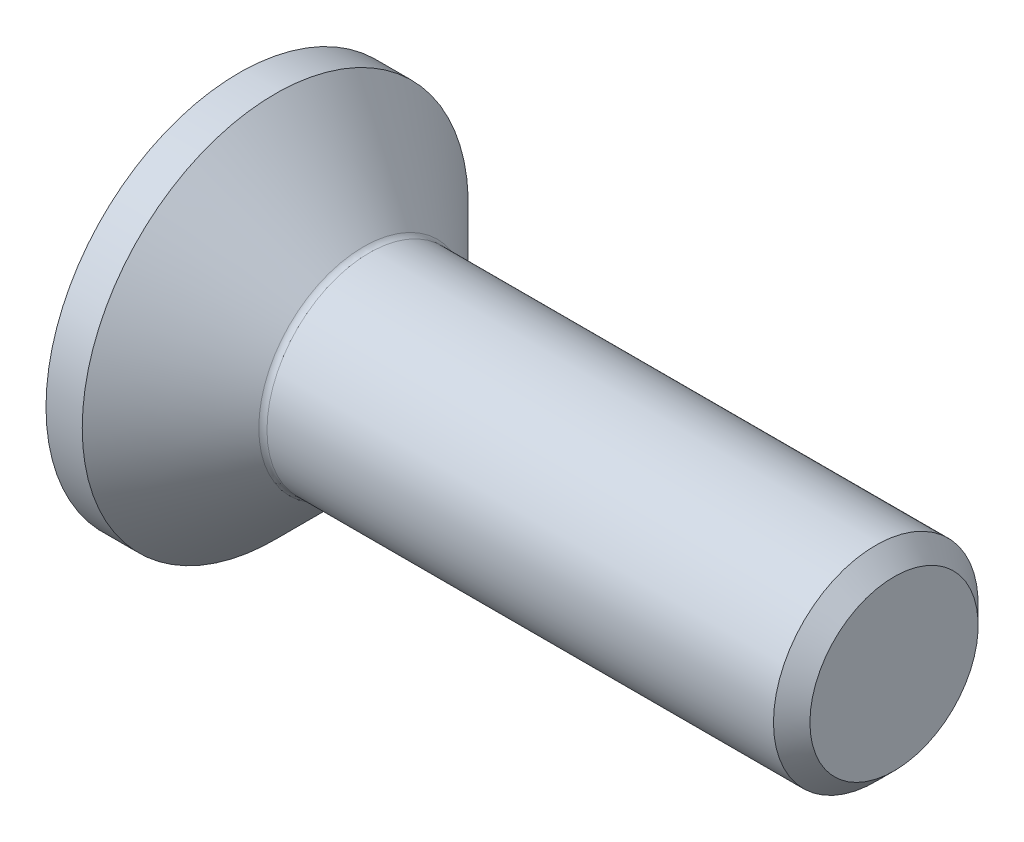
ISO-10303-21;
HEADER;
FILE_DESCRIPTION(('STEP AP214'),'2;1');
FILE_NAME('part.step','',(''),(''),'','','');
FILE_SCHEMA(('AUTOMOTIVE_DESIGN { 1 0 10303 214 1 1 1 1 }'));
ENDSEC;
DATA;
#1=APPLICATION_CONTEXT('core data for automotive mechanical design processes');
#2=APPLICATION_PROTOCOL_DEFINITION('international standard','automotive_design',2000,#1);
#3=PRODUCT_CONTEXT('',#1,'mechanical');
#4=PRODUCT('Part','Part','',(#3));
#5=PRODUCT_RELATED_PRODUCT_CATEGORY('part','',(#4));
#6=PRODUCT_DEFINITION_FORMATION('','',#4);
#7=PRODUCT_DEFINITION_CONTEXT('part definition',#1,'design');
#8=PRODUCT_DEFINITION('design','',#6,#7);
#9=PRODUCT_DEFINITION_SHAPE('','',#8);
#10=(LENGTH_UNIT() NAMED_UNIT(*) SI_UNIT(.MILLI.,.METRE.));
#11=(NAMED_UNIT(*) PLANE_ANGLE_UNIT() SI_UNIT($,.RADIAN.));
#12=(NAMED_UNIT(*) SI_UNIT($,.STERADIAN.) SOLID_ANGLE_UNIT());
#13=UNCERTAINTY_MEASURE_WITH_UNIT(LENGTH_MEASURE(1.E-05),#10,'distance_accuracy_value','');
#14=(GEOMETRIC_REPRESENTATION_CONTEXT(3) GLOBAL_UNCERTAINTY_ASSIGNED_CONTEXT((#13)) GLOBAL_UNIT_ASSIGNED_CONTEXT((#10,
#11,#12)) REPRESENTATION_CONTEXT('',''));
#15=CARTESIAN_POINT('',(0.,0.,0.));
#16=DIRECTION('',(0.,0.,1.));
#17=DIRECTION('',(1.,0.,0.));
#18=AXIS2_PLACEMENT_3D('',#15,#16,#17);
#19=CARTESIAN_POINT('',(0.,0.,0.));
#20=DIRECTION('',(-1.,0.,0.));
#21=DIRECTION('',(0.,0.,1.));
#22=AXIS2_PLACEMENT_3D('',#19,#20,#21);
#23=PLANE('',#22);
#24=CARTESIAN_POINT('',(0.,0.,0.));
#25=DIRECTION('',(-1.,0.,0.));
#26=DIRECTION('',(0.,0.,1.));
#27=AXIS2_PLACEMENT_3D('',#24,#25,#26);
#28=CIRCLE('',#27,4.715);
#29=CARTESIAN_POINT('',(0.,0.,4.715));
#30=VERTEX_POINT('',#29);
#31=EDGE_CURVE('E156',#30,#30,#28,.T.);
#32=ORIENTED_EDGE('',*,*,#31,.T.);
#33=EDGE_LOOP('',(#32));
#34=FACE_BOUND('',#33,.T.);
#35=DIRECTION('',(0.,-0.499999999999999,-0.866025403784439));
#36=VECTOR('',#35,1.);
#37=CARTESIAN_POINT('',(0.,-0.866025403784438,1.5));
#38=LINE('',#37,#36);
#39=CARTESIAN_POINT('',(0.,-0.866025403784438,1.5));
#40=VERTEX_POINT('',#39);
#41=CARTESIAN_POINT('',(0.,-1.73205080756887,0.));
#42=VERTEX_POINT('',#41);
#43=EDGE_CURVE('E122',#40,#42,#38,.T.);
#44=ORIENTED_EDGE('',*,*,#43,.T.);
#45=DIRECTION('',(0.,0.499999999999999,-0.866025403784439));
#46=VECTOR('',#45,1.);
#47=CARTESIAN_POINT('',(0.,-1.73205080756887,0.));
#48=LINE('',#47,#46);
#49=CARTESIAN_POINT('',(0.,-0.866025403784438,-1.5));
#50=VERTEX_POINT('',#49);
#51=EDGE_CURVE('E53',#42,#50,#48,.T.);
#52=ORIENTED_EDGE('',*,*,#51,.T.);
#53=DIRECTION('',(0.,1.,0.));
#54=VECTOR('',#53,1.);
#55=CARTESIAN_POINT('',(0.,-0.866025403784438,-1.5));
#56=LINE('',#55,#54);
#57=CARTESIAN_POINT('',(0.,0.866025403784438,-1.5));
#58=VERTEX_POINT('',#57);
#59=EDGE_CURVE('E133',#50,#58,#56,.T.);
#60=ORIENTED_EDGE('',*,*,#59,.T.);
#61=DIRECTION('',(0.,0.500000000000001,0.866025403784438));
#62=VECTOR('',#61,1.);
#63=CARTESIAN_POINT('',(0.,0.866025403784438,-1.5));
#64=LINE('',#63,#62);
#65=CARTESIAN_POINT('',(0.,1.73205080756888,0.));
#66=VERTEX_POINT('',#65);
#67=EDGE_CURVE('E257',#58,#66,#64,.T.);
#68=ORIENTED_EDGE('',*,*,#67,.T.);
#69=DIRECTION('',(0.,-0.5,0.866025403784438));
#70=VECTOR('',#69,1.);
#71=CARTESIAN_POINT('',(0.,1.73205080756888,0.));
#72=LINE('',#71,#70);
#73=CARTESIAN_POINT('',(0.,0.866025403784438,1.5));
#74=VERTEX_POINT('',#73);
#75=EDGE_CURVE('E260',#66,#74,#72,.T.);
#76=ORIENTED_EDGE('',*,*,#75,.T.);
#77=DIRECTION('',(0.,-1.,0.));
#78=VECTOR('',#77,1.);
#79=CARTESIAN_POINT('',(0.,0.866025403784438,1.5));
#80=LINE('',#79,#78);
#81=EDGE_CURVE('E263',#74,#40,#80,.T.);
#82=ORIENTED_EDGE('',*,*,#81,.T.);
#83=EDGE_LOOP('',(#44,#52,#60,#68,#76,#82));
#84=FACE_BOUND('',#83,.T.);
#85=ADVANCED_FACE('F38',(#34,#84),#23,.T.);
#86=CARTESIAN_POINT('',(0.,0.,0.));
#87=DIRECTION('',(-1.,0.,0.));
#88=DIRECTION('',(0.,0.,1.));
#89=AXIS2_PLACEMENT_3D('',#86,#87,#88);
#90=CYLINDRICAL_SURFACE('',#89,4.715);
#91=CARTESIAN_POINT('',(0.885000000000013,0.,0.));
#92=DIRECTION('',(-1.,0.,0.));
#93=DIRECTION('',(0.,0.,1.));
#94=AXIS2_PLACEMENT_3D('',#91,#92,#93);
#95=CIRCLE('',#94,4.715);
#96=CARTESIAN_POINT('',(0.885000000000013,0.,4.715));
#97=VERTEX_POINT('',#96);
#98=EDGE_CURVE('E153',#97,#97,#95,.T.);
#99=ORIENTED_EDGE('',*,*,#98,.T.);
#100=EDGE_LOOP('',(#99));
#101=FACE_BOUND('',#100,.T.);
#102=ORIENTED_EDGE('',*,*,#31,.F.);
#103=EDGE_LOOP('',(#102));
#104=FACE_BOUND('',#103,.T.);
#105=ADVANCED_FACE('F177',(#101,#104),#90,.T.);
#106=CARTESIAN_POINT('',(0.885000000000013,0.,0.));
#107=DIRECTION('',(-1.,0.,0.));
#108=DIRECTION('',(0.,0.,1.));
#109=AXIS2_PLACEMENT_3D('',#106,#107,#108);
#110=CONICAL_SURFACE('',#109,4.715,0.78539816339745);
#111=CARTESIAN_POINT('',(3.04142135623734,0.,0.));
#112=DIRECTION('',(-1.,0.,0.));
#113=DIRECTION('',(0.,0.,1.));
#114=AXIS2_PLACEMENT_3D('',#111,#112,#113);
#115=CIRCLE('',#114,2.55857864376267);
#116=CARTESIAN_POINT('',(3.04142135623734,0.,2.55857864376267));
#117=VERTEX_POINT('',#116);
#118=EDGE_CURVE('E46',#117,#117,#115,.T.);
#119=ORIENTED_EDGE('',*,*,#118,.T.);
#120=EDGE_LOOP('',(#119));
#121=FACE_BOUND('',#120,.T.);
#122=ORIENTED_EDGE('',*,*,#98,.F.);
#123=EDGE_LOOP('',(#122));
#124=FACE_BOUND('',#123,.T.);
#125=ADVANCED_FACE('F161',(#121,#124),#110,.T.);
#126=CARTESIAN_POINT('',(0.,0.,0.));
#127=DIRECTION('',(-1.,0.,0.));
#128=DIRECTION('',(0.,0.,1.));
#129=AXIS2_PLACEMENT_3D('',#126,#127,#128);
#130=CYLINDRICAL_SURFACE('',#129,2.49999999999998);
#131=CARTESIAN_POINT('',(3.18284271247464,0.,0.));
#132=DIRECTION('',(-1.,0.,0.));
#133=DIRECTION('',(0.,0.,1.));
#134=AXIS2_PLACEMENT_3D('',#131,#132,#133);
#135=CIRCLE('',#134,2.49999999999998);
#136=CARTESIAN_POINT('',(3.18284271247464,0.,2.49999999999998));
#137=VERTEX_POINT('',#136);
#138=EDGE_CURVE('E11',#137,#137,#135,.F.);
#139=ORIENTED_EDGE('',*,*,#138,.T.);
#140=EDGE_LOOP('',(#139));
#141=FACE_BOUND('',#140,.T.);
#142=CARTESIAN_POINT('',(15.555,0.,0.));
#143=DIRECTION('',(-1.,0.,0.));
#144=DIRECTION('',(0.,0.,1.));
#145=AXIS2_PLACEMENT_3D('',#142,#143,#144);
#146=CIRCLE('',#145,2.49999999999996);
#147=CARTESIAN_POINT('',(15.555,0.,2.49999999999996));
#148=VERTEX_POINT('',#147);
#149=EDGE_CURVE('E150',#148,#148,#146,.T.);
#150=ORIENTED_EDGE('',*,*,#149,.T.);
#151=EDGE_LOOP('',(#150));
#152=FACE_BOUND('',#151,.T.);
#153=ADVANCED_FACE('F188',(#141,#152),#130,.T.);
#154=CARTESIAN_POINT('',(16.,0.,0.));
#155=DIRECTION('',(-1.,0.,0.));
#156=DIRECTION('',(0.,0.,1.));
#157=AXIS2_PLACEMENT_3D('',#154,#155,#156);
#158=CONICAL_SURFACE('',#157,2.055,0.785398163397368);
#159=ORIENTED_EDGE('',*,*,#149,.F.);
#160=EDGE_LOOP('',(#159));
#161=FACE_BOUND('',#160,.T.);
#162=CARTESIAN_POINT('',(16.,0.,0.));
#163=DIRECTION('',(-1.,0.,0.));
#164=DIRECTION('',(0.,0.,1.));
#165=AXIS2_PLACEMENT_3D('',#162,#163,#164);
#166=CIRCLE('',#165,2.055);
#167=CARTESIAN_POINT('',(16.,0.,2.055));
#168=VERTEX_POINT('',#167);
#169=EDGE_CURVE('E146',#168,#168,#166,.T.);
#170=ORIENTED_EDGE('',*,*,#169,.T.);
#171=EDGE_LOOP('',(#170));
#172=FACE_BOUND('',#171,.T.);
#173=ADVANCED_FACE('F172',(#161,#172),#158,.T.);
#174=CARTESIAN_POINT('',(16.,2.055,0.));
#175=DIRECTION('',(1.,0.,0.));
#176=DIRECTION('',(0.,0.,-1.));
#177=AXIS2_PLACEMENT_3D('',#174,#175,#176);
#178=PLANE('',#177);
#179=ORIENTED_EDGE('',*,*,#169,.F.);
#180=EDGE_LOOP('',(#179));
#181=FACE_BOUND('',#180,.T.);
#182=ADVANCED_FACE('F165',(#181),#178,.T.);
#183=CARTESIAN_POINT('',(3.18284271247464,0.,0.));
#184=DIRECTION('',(-1.,0.,0.));
#185=DIRECTION('',(0.,0.,1.));
#186=AXIS2_PLACEMENT_3D('',#183,#184,#185);
#187=TOROIDAL_SURFACE('',#186,2.69999999999998,0.2);
#188=ORIENTED_EDGE('',*,*,#138,.F.);
#189=EDGE_LOOP('',(#188));
#190=FACE_BOUND('',#189,.T.);
#191=ORIENTED_EDGE('',*,*,#118,.F.);
#192=EDGE_LOOP('',(#191));
#193=FACE_BOUND('',#192,.T.);
#194=ADVANCED_FACE('F40',(#190,#193),#187,.F.);
#195=CARTESIAN_POINT('',(1.9,-1.73205080756887,0.));
#196=DIRECTION('',(0.,0.866025403784439,0.499999999999999));
#197=DIRECTION('',(0.,-0.499999999999999,0.866025403784439));
#198=AXIS2_PLACEMENT_3D('',#195,#196,#197);
#199=PLANE('',#198);
#200=ORIENTED_EDGE('',*,*,#51,.F.);
#201=DIRECTION('',(-1.,0.,0.));
#202=VECTOR('',#201,1.);
#203=CARTESIAN_POINT('',(1.9,-1.73205080756887,0.));
#204=LINE('',#203,#202);
#205=CARTESIAN_POINT('',(1.9,-1.73205080756887,0.));
#206=VERTEX_POINT('',#205);
#207=EDGE_CURVE('E254',#206,#42,#204,.T.);
#208=ORIENTED_EDGE('',*,*,#207,.F.);
#209=DIRECTION('',(0.,0.499999999999999,-0.866025403784439));
#210=VECTOR('',#209,1.);
#211=CARTESIAN_POINT('',(1.9,-1.73205080756887,0.));
#212=LINE('',#211,#210);
#213=CARTESIAN_POINT('',(1.9,-1.29903810567666,-0.749999999999998));
#214=VERTEX_POINT('',#213);
#215=EDGE_CURVE('E118',#206,#214,#212,.T.);
#216=ORIENTED_EDGE('',*,*,#215,.T.);
#217=CARTESIAN_POINT('',(1.9,-0.866025403784438,-1.5));
#218=VERTEX_POINT('',#217);
#219=EDGE_CURVE('E114',#214,#218,#212,.T.);
#220=ORIENTED_EDGE('',*,*,#219,.T.);
#221=DIRECTION('',(-1.,0.,0.));
#222=VECTOR('',#221,1.);
#223=CARTESIAN_POINT('',(1.9,-0.866025403784438,-1.5));
#224=LINE('',#223,#222);
#225=EDGE_CURVE('E116',#218,#50,#224,.T.);
#226=ORIENTED_EDGE('',*,*,#225,.T.);
#227=EDGE_LOOP('',(#200,#208,#216,#220,#226));
#228=FACE_BOUND('',#227,.T.);
#229=ADVANCED_FACE('F115',(#228),#199,.T.);
#230=CARTESIAN_POINT('',(1.9,-0.866025403784438,-1.5));
#231=DIRECTION('',(0.,0.,1.));
#232=DIRECTION('',(0.,-1.,0.));
#233=AXIS2_PLACEMENT_3D('',#230,#231,#232);
#234=PLANE('',#233);
#235=ORIENTED_EDGE('',*,*,#59,.F.);
#236=ORIENTED_EDGE('',*,*,#225,.F.);
#237=DIRECTION('',(0.,1.,0.));
#238=VECTOR('',#237,1.);
#239=CARTESIAN_POINT('',(1.9,-0.866025403784438,-1.5));
#240=LINE('',#239,#238);
#241=CARTESIAN_POINT('',(1.9,0.,-1.5));
#242=VERTEX_POINT('',#241);
#243=EDGE_CURVE('E61',#218,#242,#240,.T.);
#244=ORIENTED_EDGE('',*,*,#243,.T.);
#245=CARTESIAN_POINT('',(1.9,0.866025403784438,-1.5));
#246=VERTEX_POINT('',#245);
#247=EDGE_CURVE('E128',#242,#246,#240,.T.);
#248=ORIENTED_EDGE('',*,*,#247,.T.);
#249=DIRECTION('',(-1.,0.,0.));
#250=VECTOR('',#249,1.);
#251=CARTESIAN_POINT('',(1.9,0.866025403784438,-1.5));
#252=LINE('',#251,#250);
#253=EDGE_CURVE('E135',#246,#58,#252,.T.);
#254=ORIENTED_EDGE('',*,*,#253,.T.);
#255=EDGE_LOOP('',(#235,#236,#244,#248,#254));
#256=FACE_BOUND('',#255,.T.);
#257=ADVANCED_FACE('F130',(#256),#234,.T.);
#258=CARTESIAN_POINT('',(1.9,0.866025403784438,-1.5));
#259=DIRECTION('',(0.,-0.866025403784438,0.500000000000001));
#260=DIRECTION('',(0.,-0.500000000000001,-0.866025403784438));
#261=AXIS2_PLACEMENT_3D('',#258,#259,#260);
#262=PLANE('',#261);
#263=ORIENTED_EDGE('',*,*,#67,.F.);
#264=ORIENTED_EDGE('',*,*,#253,.F.);
#265=DIRECTION('',(0.,0.500000000000001,0.866025403784438));
#266=VECTOR('',#265,1.);
#267=CARTESIAN_POINT('',(1.9,0.866025403784438,-1.5));
#268=LINE('',#267,#266);
#269=CARTESIAN_POINT('',(1.9,1.29903810567666,-0.750000000000003));
#270=VERTEX_POINT('',#269);
#271=EDGE_CURVE('E235',#246,#270,#268,.T.);
#272=ORIENTED_EDGE('',*,*,#271,.T.);
#273=CARTESIAN_POINT('',(1.9,1.73205080756888,0.));
#274=VERTEX_POINT('',#273);
#275=EDGE_CURVE('E127',#270,#274,#268,.T.);
#276=ORIENTED_EDGE('',*,*,#275,.T.);
#277=DIRECTION('',(-1.,0.,0.));
#278=VECTOR('',#277,1.);
#279=CARTESIAN_POINT('',(1.9,1.73205080756888,0.));
#280=LINE('',#279,#278);
#281=EDGE_CURVE('E141',#274,#66,#280,.T.);
#282=ORIENTED_EDGE('',*,*,#281,.T.);
#283=EDGE_LOOP('',(#263,#264,#272,#276,#282));
#284=FACE_BOUND('',#283,.T.);
#285=ADVANCED_FACE('F202',(#284),#262,.T.);
#286=CARTESIAN_POINT('',(1.9,1.73205080756888,0.));
#287=DIRECTION('',(0.,-0.866025403784439,-0.5));
#288=DIRECTION('',(0.,0.5,-0.866025403784439));
#289=AXIS2_PLACEMENT_3D('',#286,#287,#288);
#290=PLANE('',#289);
#291=ORIENTED_EDGE('',*,*,#75,.F.);
#292=ORIENTED_EDGE('',*,*,#281,.F.);
#293=DIRECTION('',(0.,-0.5,0.866025403784438));
#294=VECTOR('',#293,1.);
#295=CARTESIAN_POINT('',(1.9,1.73205080756888,0.));
#296=LINE('',#295,#294);
#297=CARTESIAN_POINT('',(1.9,1.29903810567666,0.750000000000001));
#298=VERTEX_POINT('',#297);
#299=EDGE_CURVE('E242',#274,#298,#296,.T.);
#300=ORIENTED_EDGE('',*,*,#299,.T.);
#301=CARTESIAN_POINT('',(1.9,0.866025403784438,1.5));
#302=VERTEX_POINT('',#301);
#303=EDGE_CURVE('E240',#298,#302,#296,.T.);
#304=ORIENTED_EDGE('',*,*,#303,.T.);
#305=DIRECTION('',(-1.,0.,0.));
#306=VECTOR('',#305,1.);
#307=CARTESIAN_POINT('',(1.9,0.866025403784438,1.5));
#308=LINE('',#307,#306);
#309=EDGE_CURVE('E272',#302,#74,#308,.T.);
#310=ORIENTED_EDGE('',*,*,#309,.T.);
#311=EDGE_LOOP('',(#291,#292,#300,#304,#310));
#312=FACE_BOUND('',#311,.T.);
#313=ADVANCED_FACE('F205',(#312),#290,.T.);
#314=CARTESIAN_POINT('',(1.9,0.866025403784438,1.5));
#315=DIRECTION('',(0.,0.,-1.));
#316=DIRECTION('',(0.,1.,0.));
#317=AXIS2_PLACEMENT_3D('',#314,#315,#316);
#318=PLANE('',#317);
#319=ORIENTED_EDGE('',*,*,#81,.F.);
#320=ORIENTED_EDGE('',*,*,#309,.F.);
#321=DIRECTION('',(0.,-1.,0.));
#322=VECTOR('',#321,1.);
#323=CARTESIAN_POINT('',(1.9,0.866025403784438,1.5));
#324=LINE('',#323,#322);
#325=CARTESIAN_POINT('',(1.9,0.,1.5));
#326=VERTEX_POINT('',#325);
#327=EDGE_CURVE('E247',#302,#326,#324,.T.);
#328=ORIENTED_EDGE('',*,*,#327,.T.);
#329=CARTESIAN_POINT('',(1.9,-0.866025403784438,1.5));
#330=VERTEX_POINT('',#329);
#331=EDGE_CURVE('E246',#326,#330,#324,.T.);
#332=ORIENTED_EDGE('',*,*,#331,.T.);
#333=DIRECTION('',(-1.,0.,0.));
#334=VECTOR('',#333,1.);
#335=CARTESIAN_POINT('',(1.9,-0.866025403784438,1.5));
#336=LINE('',#335,#334);
#337=EDGE_CURVE('E269',#330,#40,#336,.T.);
#338=ORIENTED_EDGE('',*,*,#337,.T.);
#339=EDGE_LOOP('',(#319,#320,#328,#332,#338));
#340=FACE_BOUND('',#339,.T.);
#341=ADVANCED_FACE('F209',(#340),#318,.T.);
#342=CARTESIAN_POINT('',(1.9,-0.866025403784438,1.5));
#343=DIRECTION('',(0.,0.866025403784439,-0.499999999999999));
#344=DIRECTION('',(0.,0.499999999999999,0.866025403784439));
#345=AXIS2_PLACEMENT_3D('',#342,#343,#344);
#346=PLANE('',#345);
#347=ORIENTED_EDGE('',*,*,#43,.F.);
#348=ORIENTED_EDGE('',*,*,#337,.F.);
#349=DIRECTION('',(0.,-0.499999999999999,-0.866025403784439));
#350=VECTOR('',#349,1.);
#351=CARTESIAN_POINT('',(1.9,-0.866025403784438,1.5));
#352=LINE('',#351,#350);
#353=CARTESIAN_POINT('',(1.9,-1.29903810567666,0.749999999999997));
#354=VERTEX_POINT('',#353);
#355=EDGE_CURVE('E251',#330,#354,#352,.T.);
#356=ORIENTED_EDGE('',*,*,#355,.T.);
#357=EDGE_CURVE('E250',#354,#206,#352,.T.);
#358=ORIENTED_EDGE('',*,*,#357,.T.);
#359=ORIENTED_EDGE('',*,*,#207,.T.);
#360=EDGE_LOOP('',(#347,#348,#356,#358,#359));
#361=FACE_BOUND('',#360,.T.);
#362=ADVANCED_FACE('F213',(#361),#346,.T.);
#363=CARTESIAN_POINT('',(1.9,-0.866025403784437,-1.5));
#364=DIRECTION('',(1.,0.,0.));
#365=DIRECTION('',(0.,0.,-1.));
#366=AXIS2_PLACEMENT_3D('',#363,#364,#365);
#367=PLANE('',#366);
#368=ORIENTED_EDGE('',*,*,#243,.F.);
#369=ORIENTED_EDGE('',*,*,#219,.F.);
#370=CARTESIAN_POINT('',(1.9,0.,0.));
#371=DIRECTION('',(-1.,0.,0.));
#372=DIRECTION('',(0.,0.,1.));
#373=AXIS2_PLACEMENT_3D('',#370,#371,#372);
#374=CIRCLE('',#373,1.5);
#375=EDGE_CURVE('E125',#242,#214,#374,.T.);
#376=ORIENTED_EDGE('',*,*,#375,.F.);
#377=EDGE_LOOP('',(#368,#369,#376));
#378=FACE_BOUND('',#377,.T.);
#379=ADVANCED_FACE('F124',(#378),#367,.F.);
#380=ORIENTED_EDGE('',*,*,#215,.F.);
#381=ORIENTED_EDGE('',*,*,#357,.F.);
#382=EDGE_CURVE('E138',#214,#354,#374,.T.);
#383=ORIENTED_EDGE('',*,*,#382,.F.);
#384=EDGE_LOOP('',(#380,#381,#383));
#385=FACE_BOUND('',#384,.T.);
#386=ADVANCED_FACE('F219',(#385),#367,.F.);
#387=ORIENTED_EDGE('',*,*,#355,.F.);
#388=ORIENTED_EDGE('',*,*,#331,.F.);
#389=EDGE_CURVE('E134',#354,#326,#374,.T.);
#390=ORIENTED_EDGE('',*,*,#389,.F.);
#391=EDGE_LOOP('',(#387,#388,#390));
#392=FACE_BOUND('',#391,.T.);
#393=ADVANCED_FACE('F223',(#392),#367,.F.);
#394=ORIENTED_EDGE('',*,*,#327,.F.);
#395=ORIENTED_EDGE('',*,*,#303,.F.);
#396=EDGE_CURVE('E140',#326,#298,#374,.T.);
#397=ORIENTED_EDGE('',*,*,#396,.F.);
#398=EDGE_LOOP('',(#394,#395,#397));
#399=FACE_BOUND('',#398,.T.);
#400=ADVANCED_FACE('F231',(#399),#367,.F.);
#401=ORIENTED_EDGE('',*,*,#299,.F.);
#402=ORIENTED_EDGE('',*,*,#275,.F.);
#403=EDGE_CURVE('E147',#298,#270,#374,.T.);
#404=ORIENTED_EDGE('',*,*,#403,.F.);
#405=EDGE_LOOP('',(#401,#402,#404));
#406=FACE_BOUND('',#405,.T.);
#407=ADVANCED_FACE('F226',(#406),#367,.F.);
#408=ORIENTED_EDGE('',*,*,#271,.F.);
#409=ORIENTED_EDGE('',*,*,#247,.F.);
#410=EDGE_CURVE('E236',#270,#242,#374,.T.);
#411=ORIENTED_EDGE('',*,*,#410,.F.);
#412=EDGE_LOOP('',(#408,#409,#411));
#413=FACE_BOUND('',#412,.T.);
#414=ADVANCED_FACE('F197',(#413),#367,.F.);
#415=CARTESIAN_POINT('',(1.9,0.,0.));
#416=DIRECTION('',(-1.,0.,0.));
#417=DIRECTION('',(0.,0.,1.));
#418=AXIS2_PLACEMENT_3D('',#415,#416,#417);
#419=CONICAL_SURFACE('',#418,1.5,1.04719755119659);
#420=CARTESIAN_POINT('',(2.76602540378445,0.,0.));
#421=VERTEX_POINT('',#420);
#422=VERTEX_LOOP('',#421);
#423=FACE_BOUND('',#422,.T.);
#424=ORIENTED_EDGE('',*,*,#396,.T.);
#425=ORIENTED_EDGE('',*,*,#403,.T.);
#426=ORIENTED_EDGE('',*,*,#410,.T.);
#427=ORIENTED_EDGE('',*,*,#375,.T.);
#428=ORIENTED_EDGE('',*,*,#382,.T.);
#429=ORIENTED_EDGE('',*,*,#389,.T.);
#430=EDGE_LOOP('',(#424,#425,#426,#427,#428,#429));
#431=FACE_BOUND('',#430,.T.);
#432=ADVANCED_FACE('F195',(#423,#431),#419,.F.);
#433=CLOSED_SHELL('',(#85,#105,#125,#153,#173,#182,#194,#229,#257,#285,#313,#341,#362,#379,#386,
#393,#400,#407,#414,#432));
#434=MANIFOLD_SOLID_BREP('B2',#433);
#435=ADVANCED_BREP_SHAPE_REPRESENTATION('',(#18,#434),#14);
#436=SHAPE_DEFINITION_REPRESENTATION(#9,#435);
ENDSEC;
END-ISO-10303-21;
